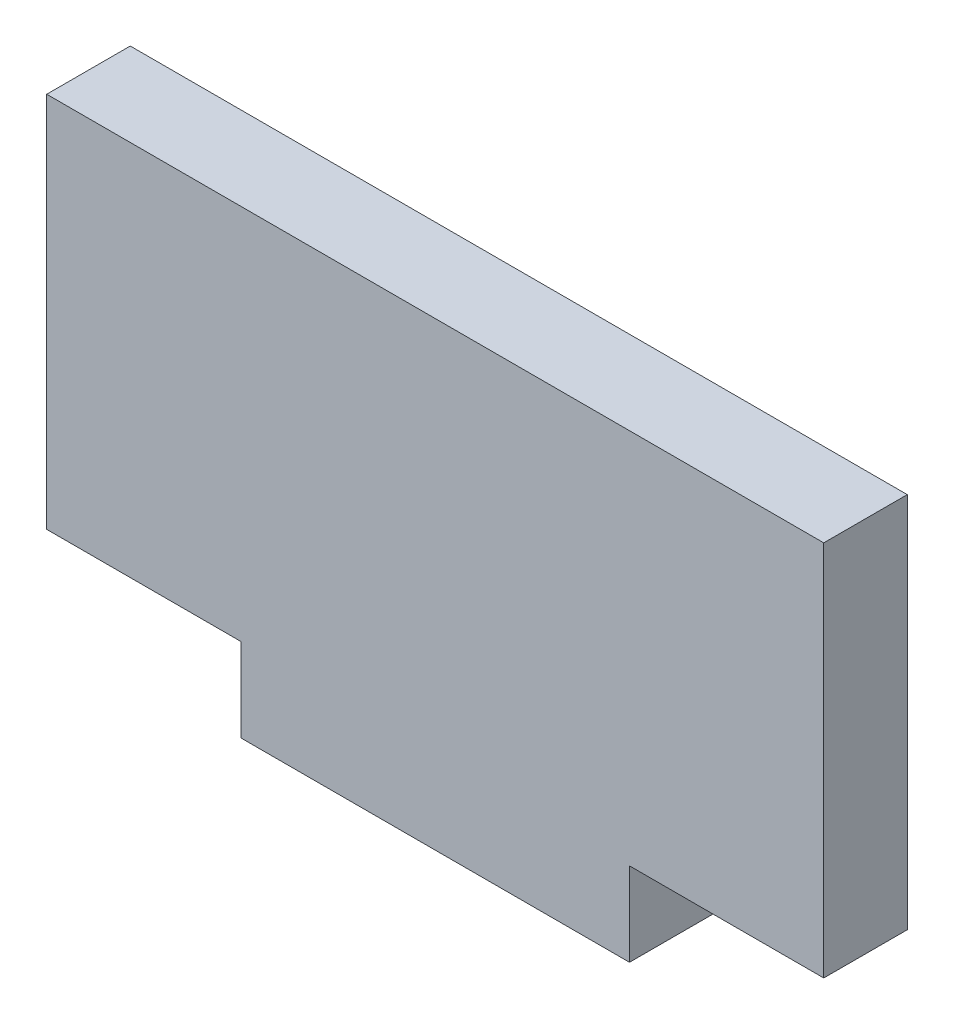
ISO-10303-21;
HEADER;
FILE_DESCRIPTION(('STEP AP214'),'2;1');
FILE_NAME('part.step','',(''),(''),'','','');
FILE_SCHEMA(('AUTOMOTIVE_DESIGN { 1 0 10303 214 1 1 1 1 }'));
ENDSEC;
DATA;
#1=APPLICATION_CONTEXT('core data for automotive mechanical design processes');
#2=APPLICATION_PROTOCOL_DEFINITION('international standard','automotive_design',2000,#1);
#3=PRODUCT_CONTEXT('',#1,'mechanical');
#4=PRODUCT('Part','Part','',(#3));
#5=PRODUCT_RELATED_PRODUCT_CATEGORY('part','',(#4));
#6=PRODUCT_DEFINITION_FORMATION('','',#4);
#7=PRODUCT_DEFINITION_CONTEXT('part definition',#1,'design');
#8=PRODUCT_DEFINITION('design','',#6,#7);
#9=PRODUCT_DEFINITION_SHAPE('','',#8);
#10=(LENGTH_UNIT() NAMED_UNIT(*) SI_UNIT(.MILLI.,.METRE.));
#11=(NAMED_UNIT(*) PLANE_ANGLE_UNIT() SI_UNIT($,.RADIAN.));
#12=(NAMED_UNIT(*) SI_UNIT($,.STERADIAN.) SOLID_ANGLE_UNIT());
#13=UNCERTAINTY_MEASURE_WITH_UNIT(LENGTH_MEASURE(1.E-05),#10,'distance_accuracy_value','');
#14=(GEOMETRIC_REPRESENTATION_CONTEXT(3) GLOBAL_UNCERTAINTY_ASSIGNED_CONTEXT((#13)) GLOBAL_UNIT_ASSIGNED_CONTEXT((#10,
#11,#12)) REPRESENTATION_CONTEXT('',''));
#15=CARTESIAN_POINT('',(0.,0.,0.));
#16=DIRECTION('',(0.,0.,1.));
#17=DIRECTION('',(1.,0.,0.));
#18=AXIS2_PLACEMENT_3D('',#15,#16,#17);
#19=CARTESIAN_POINT('',(25.4,0.,5.461));
#20=DIRECTION('',(1.,0.,0.));
#21=DIRECTION('',(0.,0.,-1.));
#22=AXIS2_PLACEMENT_3D('',#19,#20,#21);
#23=PLANE('',#22);
#24=DIRECTION('',(0.,-1.,0.));
#25=VECTOR('',#24,1.);
#26=CARTESIAN_POINT('',(25.4,0.,0.));
#27=LINE('',#26,#25);
#28=CARTESIAN_POINT('',(25.4,27.3685,0.));
#29=VERTEX_POINT('',#28);
#30=CARTESIAN_POINT('',(25.4,2.7305,0.));
#31=VERTEX_POINT('',#30);
#32=EDGE_CURVE('E129',#29,#31,#27,.T.);
#33=ORIENTED_EDGE('',*,*,#32,.F.);
#34=DIRECTION('',(0.,0.,-1.));
#35=VECTOR('',#34,1.);
#36=CARTESIAN_POINT('',(25.4,27.3685,5.461));
#37=LINE('',#36,#35);
#38=CARTESIAN_POINT('',(25.4,27.3685,5.461));
#39=VERTEX_POINT('',#38);
#40=EDGE_CURVE('E11',#39,#29,#37,.T.);
#41=ORIENTED_EDGE('',*,*,#40,.F.);
#42=DIRECTION('',(0.,-1.,0.));
#43=VECTOR('',#42,1.);
#44=CARTESIAN_POINT('',(25.4,0.,5.461));
#45=LINE('',#44,#43);
#46=CARTESIAN_POINT('',(25.4,2.7305,5.461));
#47=VERTEX_POINT('',#46);
#48=EDGE_CURVE('E169',#39,#47,#45,.T.);
#49=ORIENTED_EDGE('',*,*,#48,.T.);
#50=DIRECTION('',(0.,0.,-1.));
#51=VECTOR('',#50,1.);
#52=CARTESIAN_POINT('',(25.4,2.7305,5.461));
#53=LINE('',#52,#51);
#54=EDGE_CURVE('E85',#47,#31,#53,.T.);
#55=ORIENTED_EDGE('',*,*,#54,.T.);
#56=EDGE_LOOP('',(#33,#41,#49,#55));
#57=FACE_BOUND('',#56,.T.);
#58=ADVANCED_FACE('F35',(#57),#23,.T.);
#59=CARTESIAN_POINT('',(0.,27.3685,5.461));
#60=DIRECTION('',(0.,1.,0.));
#61=DIRECTION('',(0.,0.,1.));
#62=AXIS2_PLACEMENT_3D('',#59,#60,#61);
#63=PLANE('',#62);
#64=DIRECTION('',(1.,0.,0.));
#65=VECTOR('',#64,1.);
#66=CARTESIAN_POINT('',(0.,27.3685,0.));
#67=LINE('',#66,#65);
#68=CARTESIAN_POINT('',(-25.4,27.3685,0.));
#69=VERTEX_POINT('',#68);
#70=EDGE_CURVE('E132',#69,#29,#67,.T.);
#71=ORIENTED_EDGE('',*,*,#70,.F.);
#72=DIRECTION('',(0.,0.,-1.));
#73=VECTOR('',#72,1.);
#74=CARTESIAN_POINT('',(-25.4,27.3685,5.461));
#75=LINE('',#74,#73);
#76=CARTESIAN_POINT('',(-25.4,27.3685,5.461));
#77=VERTEX_POINT('',#76);
#78=EDGE_CURVE('E43',#77,#69,#75,.T.);
#79=ORIENTED_EDGE('',*,*,#78,.F.);
#80=DIRECTION('',(1.,0.,0.));
#81=VECTOR('',#80,1.);
#82=CARTESIAN_POINT('',(0.,27.3685,5.461));
#83=LINE('',#82,#81);
#84=EDGE_CURVE('E168',#77,#39,#83,.T.);
#85=ORIENTED_EDGE('',*,*,#84,.T.);
#86=ORIENTED_EDGE('',*,*,#40,.T.);
#87=EDGE_LOOP('',(#71,#79,#85,#86));
#88=FACE_BOUND('',#87,.T.);
#89=ADVANCED_FACE('F167',(#88),#63,.T.);
#90=CARTESIAN_POINT('',(-25.4,0.,5.461));
#91=DIRECTION('',(1.,0.,0.));
#92=DIRECTION('',(0.,0.,-1.));
#93=AXIS2_PLACEMENT_3D('',#90,#91,#92);
#94=PLANE('',#93);
#95=DIRECTION('',(0.,-1.,0.));
#96=VECTOR('',#95,1.);
#97=CARTESIAN_POINT('',(-25.4,0.,0.));
#98=LINE('',#97,#96);
#99=CARTESIAN_POINT('',(-25.4,2.7305,0.));
#100=VERTEX_POINT('',#99);
#101=EDGE_CURVE('E135',#69,#100,#98,.T.);
#102=ORIENTED_EDGE('',*,*,#101,.T.);
#103=DIRECTION('',(0.,0.,-1.));
#104=VECTOR('',#103,1.);
#105=CARTESIAN_POINT('',(-25.4,2.7305,5.461));
#106=LINE('',#105,#104);
#107=CARTESIAN_POINT('',(-25.4,2.7305,5.461));
#108=VERTEX_POINT('',#107);
#109=EDGE_CURVE('E151',#108,#100,#106,.T.);
#110=ORIENTED_EDGE('',*,*,#109,.F.);
#111=DIRECTION('',(0.,-1.,0.));
#112=VECTOR('',#111,1.);
#113=CARTESIAN_POINT('',(-25.4,0.,5.461));
#114=LINE('',#113,#112);
#115=EDGE_CURVE('E158',#77,#108,#114,.T.);
#116=ORIENTED_EDGE('',*,*,#115,.F.);
#117=ORIENTED_EDGE('',*,*,#78,.T.);
#118=EDGE_LOOP('',(#102,#110,#116,#117));
#119=FACE_BOUND('',#118,.T.);
#120=ADVANCED_FACE('F156',(#119),#94,.F.);
#121=CARTESIAN_POINT('',(0.,2.7305,5.461));
#122=DIRECTION('',(0.,1.,0.));
#123=DIRECTION('',(-1.,0.,0.));
#124=AXIS2_PLACEMENT_3D('',#121,#122,#123);
#125=PLANE('',#124);
#126=DIRECTION('',(1.,0.,0.));
#127=VECTOR('',#126,1.);
#128=CARTESIAN_POINT('',(0.,2.7305,0.));
#129=LINE('',#128,#127);
#130=CARTESIAN_POINT('',(-12.7,2.7305,0.));
#131=VERTEX_POINT('',#130);
#132=EDGE_CURVE('E137',#100,#131,#129,.T.);
#133=ORIENTED_EDGE('',*,*,#132,.T.);
#134=DIRECTION('',(0.,0.,-1.));
#135=VECTOR('',#134,1.);
#136=CARTESIAN_POINT('',(-12.7,2.7305,5.461));
#137=LINE('',#136,#135);
#138=CARTESIAN_POINT('',(-12.7,2.7305,5.461));
#139=VERTEX_POINT('',#138);
#140=EDGE_CURVE('E148',#139,#131,#137,.T.);
#141=ORIENTED_EDGE('',*,*,#140,.F.);
#142=DIRECTION('',(1.,0.,0.));
#143=VECTOR('',#142,1.);
#144=CARTESIAN_POINT('',(0.,2.7305,5.461));
#145=LINE('',#144,#143);
#146=EDGE_CURVE('E126',#108,#139,#145,.T.);
#147=ORIENTED_EDGE('',*,*,#146,.F.);
#148=ORIENTED_EDGE('',*,*,#109,.T.);
#149=EDGE_LOOP('',(#133,#141,#147,#148));
#150=FACE_BOUND('',#149,.T.);
#151=ADVANCED_FACE('F176',(#150),#125,.F.);
#152=CARTESIAN_POINT('',(-12.7,0.,5.461));
#153=DIRECTION('',(1.,0.,0.));
#154=DIRECTION('',(0.,0.,-1.));
#155=AXIS2_PLACEMENT_3D('',#152,#153,#154);
#156=PLANE('',#155);
#157=DIRECTION('',(0.,-1.,0.));
#158=VECTOR('',#157,1.);
#159=CARTESIAN_POINT('',(-12.7,0.,0.));
#160=LINE('',#159,#158);
#161=CARTESIAN_POINT('',(-12.7,-2.7305,0.));
#162=VERTEX_POINT('',#161);
#163=EDGE_CURVE('E139',#131,#162,#160,.T.);
#164=ORIENTED_EDGE('',*,*,#163,.T.);
#165=DIRECTION('',(0.,0.,-1.));
#166=VECTOR('',#165,1.);
#167=CARTESIAN_POINT('',(-12.7,-2.7305,5.461));
#168=LINE('',#167,#166);
#169=CARTESIAN_POINT('',(-12.7,-2.7305,5.461));
#170=VERTEX_POINT('',#169);
#171=EDGE_CURVE('E121',#170,#162,#168,.T.);
#172=ORIENTED_EDGE('',*,*,#171,.F.);
#173=DIRECTION('',(0.,-1.,0.));
#174=VECTOR('',#173,1.);
#175=CARTESIAN_POINT('',(-12.7,0.,5.461));
#176=LINE('',#175,#174);
#177=EDGE_CURVE('E108',#139,#170,#176,.T.);
#178=ORIENTED_EDGE('',*,*,#177,.F.);
#179=ORIENTED_EDGE('',*,*,#140,.T.);
#180=EDGE_LOOP('',(#164,#172,#178,#179));
#181=FACE_BOUND('',#180,.T.);
#182=ADVANCED_FACE('F178',(#181),#156,.F.);
#183=CARTESIAN_POINT('',(0.,-2.7305,5.461));
#184=DIRECTION('',(0.,1.,0.));
#185=DIRECTION('',(0.,0.,1.));
#186=AXIS2_PLACEMENT_3D('',#183,#184,#185);
#187=PLANE('',#186);
#188=DIRECTION('',(1.,0.,0.));
#189=VECTOR('',#188,1.);
#190=CARTESIAN_POINT('',(0.,-2.7305,0.));
#191=LINE('',#190,#189);
#192=CARTESIAN_POINT('',(12.7,-2.7305,0.));
#193=VERTEX_POINT('',#192);
#194=EDGE_CURVE('E117',#162,#193,#191,.T.);
#195=ORIENTED_EDGE('',*,*,#194,.T.);
#196=DIRECTION('',(0.,0.,-1.));
#197=VECTOR('',#196,1.);
#198=CARTESIAN_POINT('',(12.7,-2.7305,5.461));
#199=LINE('',#198,#197);
#200=CARTESIAN_POINT('',(12.7,-2.7305,5.461));
#201=VERTEX_POINT('',#200);
#202=EDGE_CURVE('E114',#201,#193,#199,.T.);
#203=ORIENTED_EDGE('',*,*,#202,.F.);
#204=DIRECTION('',(1.,0.,0.));
#205=VECTOR('',#204,1.);
#206=CARTESIAN_POINT('',(0.,-2.7305,5.461));
#207=LINE('',#206,#205);
#208=EDGE_CURVE('E102',#170,#201,#207,.T.);
#209=ORIENTED_EDGE('',*,*,#208,.F.);
#210=ORIENTED_EDGE('',*,*,#171,.T.);
#211=EDGE_LOOP('',(#195,#203,#209,#210));
#212=FACE_BOUND('',#211,.T.);
#213=ADVANCED_FACE('F115',(#212),#187,.F.);
#214=CARTESIAN_POINT('',(12.7,0.,5.461));
#215=DIRECTION('',(1.,0.,0.));
#216=DIRECTION('',(0.,0.,-1.));
#217=AXIS2_PLACEMENT_3D('',#214,#215,#216);
#218=PLANE('',#217);
#219=DIRECTION('',(0.,-1.,0.));
#220=VECTOR('',#219,1.);
#221=CARTESIAN_POINT('',(12.7,0.,0.));
#222=LINE('',#221,#220);
#223=CARTESIAN_POINT('',(12.7,2.7305,0.));
#224=VERTEX_POINT('',#223);
#225=EDGE_CURVE('E143',#224,#193,#222,.T.);
#226=ORIENTED_EDGE('',*,*,#225,.F.);
#227=DIRECTION('',(0.,0.,-1.));
#228=VECTOR('',#227,1.);
#229=CARTESIAN_POINT('',(12.7,2.7305,5.461));
#230=LINE('',#229,#228);
#231=CARTESIAN_POINT('',(12.7,2.7305,5.461));
#232=VERTEX_POINT('',#231);
#233=EDGE_CURVE('E78',#232,#224,#230,.T.);
#234=ORIENTED_EDGE('',*,*,#233,.F.);
#235=DIRECTION('',(0.,-1.,0.));
#236=VECTOR('',#235,1.);
#237=CARTESIAN_POINT('',(12.7,0.,5.461));
#238=LINE('',#237,#236);
#239=EDGE_CURVE('E106',#232,#201,#238,.T.);
#240=ORIENTED_EDGE('',*,*,#239,.T.);
#241=ORIENTED_EDGE('',*,*,#202,.T.);
#242=EDGE_LOOP('',(#226,#234,#240,#241));
#243=FACE_BOUND('',#242,.T.);
#244=ADVANCED_FACE('F123',(#243),#218,.T.);
#245=EDGE_CURVE('E140',#224,#31,#129,.T.);
#246=ORIENTED_EDGE('',*,*,#245,.T.);
#247=ORIENTED_EDGE('',*,*,#54,.F.);
#248=EDGE_CURVE('E51',#232,#47,#145,.T.);
#249=ORIENTED_EDGE('',*,*,#248,.F.);
#250=ORIENTED_EDGE('',*,*,#233,.T.);
#251=EDGE_LOOP('',(#246,#247,#249,#250));
#252=FACE_BOUND('',#251,.T.);
#253=ADVANCED_FACE('F187',(#252),#125,.F.);
#254=CARTESIAN_POINT('',(0.,0.,5.461));
#255=DIRECTION('',(0.,0.,1.));
#256=DIRECTION('',(1.,0.,0.));
#257=AXIS2_PLACEMENT_3D('',#254,#255,#256);
#258=PLANE('',#257);
#259=ORIENTED_EDGE('',*,*,#48,.F.);
#260=ORIENTED_EDGE('',*,*,#84,.F.);
#261=ORIENTED_EDGE('',*,*,#115,.T.);
#262=ORIENTED_EDGE('',*,*,#146,.T.);
#263=ORIENTED_EDGE('',*,*,#177,.T.);
#264=ORIENTED_EDGE('',*,*,#208,.T.);
#265=ORIENTED_EDGE('',*,*,#239,.F.);
#266=ORIENTED_EDGE('',*,*,#248,.T.);
#267=EDGE_LOOP('',(#259,#260,#261,#262,#263,#264,#265,#266));
#268=FACE_BOUND('',#267,.T.);
#269=ADVANCED_FACE('F104',(#268),#258,.T.);
#270=CARTESIAN_POINT('',(0.,0.,0.));
#271=DIRECTION('',(0.,0.,1.));
#272=DIRECTION('',(1.,0.,0.));
#273=AXIS2_PLACEMENT_3D('',#270,#271,#272);
#274=PLANE('',#273);
#275=ORIENTED_EDGE('',*,*,#32,.T.);
#276=ORIENTED_EDGE('',*,*,#245,.F.);
#277=ORIENTED_EDGE('',*,*,#225,.T.);
#278=ORIENTED_EDGE('',*,*,#194,.F.);
#279=ORIENTED_EDGE('',*,*,#163,.F.);
#280=ORIENTED_EDGE('',*,*,#132,.F.);
#281=ORIENTED_EDGE('',*,*,#101,.F.);
#282=ORIENTED_EDGE('',*,*,#70,.T.);
#283=EDGE_LOOP('',(#275,#276,#277,#278,#279,#280,#281,#282));
#284=FACE_BOUND('',#283,.T.);
#285=ADVANCED_FACE('F165',(#284),#274,.F.);
#286=CLOSED_SHELL('',(#58,#89,#120,#151,#182,#213,#244,#253,#269,#285));
#287=MANIFOLD_SOLID_BREP('B2',#286);
#288=ADVANCED_BREP_SHAPE_REPRESENTATION('',(#18,#287),#14);
#289=SHAPE_DEFINITION_REPRESENTATION(#9,#288);
ENDSEC;
END-ISO-10303-21;
